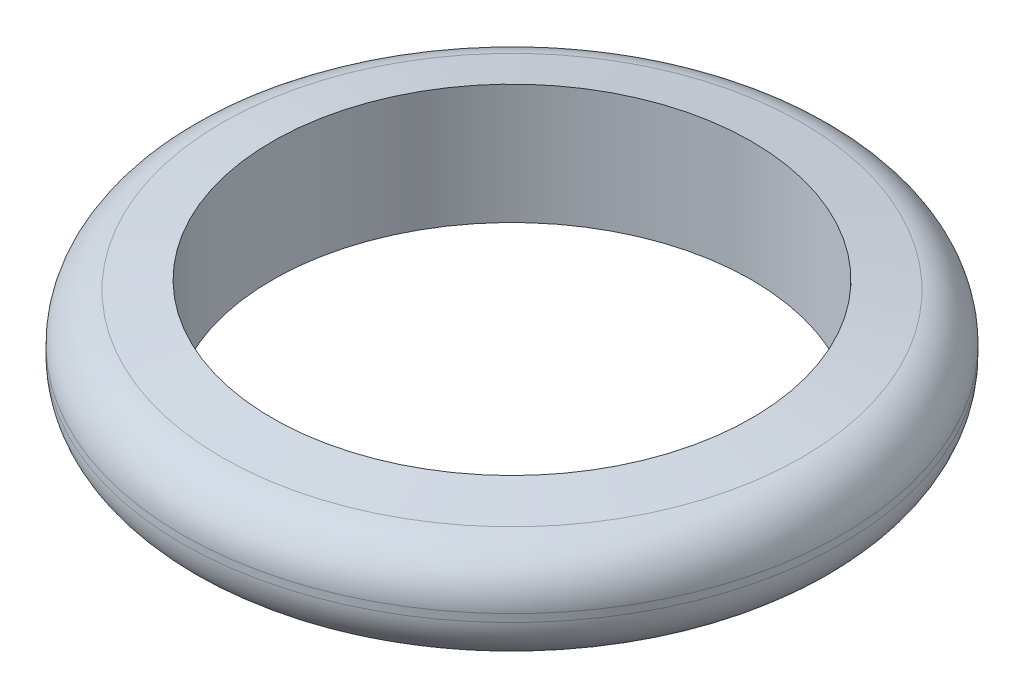
ISO-10303-21;
HEADER;
FILE_DESCRIPTION(('STEP AP214'),'2;1');
FILE_NAME('part.step','',(''),(''),'','','');
FILE_SCHEMA(('AUTOMOTIVE_DESIGN { 1 0 10303 214 1 1 1 1 }'));
ENDSEC;
DATA;
#1=APPLICATION_CONTEXT('core data for automotive mechanical design processes');
#2=APPLICATION_PROTOCOL_DEFINITION('international standard','automotive_design',2000,#1);
#3=PRODUCT_CONTEXT('',#1,'mechanical');
#4=PRODUCT('Part','Part','',(#3));
#5=PRODUCT_RELATED_PRODUCT_CATEGORY('part','',(#4));
#6=PRODUCT_DEFINITION_FORMATION('','',#4);
#7=PRODUCT_DEFINITION_CONTEXT('part definition',#1,'design');
#8=PRODUCT_DEFINITION('design','',#6,#7);
#9=PRODUCT_DEFINITION_SHAPE('','',#8);
#10=(LENGTH_UNIT() NAMED_UNIT(*) SI_UNIT(.MILLI.,.METRE.));
#11=(NAMED_UNIT(*) PLANE_ANGLE_UNIT() SI_UNIT($,.RADIAN.));
#12=(NAMED_UNIT(*) SI_UNIT($,.STERADIAN.) SOLID_ANGLE_UNIT());
#13=UNCERTAINTY_MEASURE_WITH_UNIT(LENGTH_MEASURE(1.E-05),#10,'distance_accuracy_value','');
#14=(GEOMETRIC_REPRESENTATION_CONTEXT(3) GLOBAL_UNCERTAINTY_ASSIGNED_CONTEXT((#13)) GLOBAL_UNIT_ASSIGNED_CONTEXT((#10,
#11,#12)) REPRESENTATION_CONTEXT('',''));
#15=CARTESIAN_POINT('',(0.,0.,0.));
#16=DIRECTION('',(0.,0.,1.));
#17=DIRECTION('',(1.,0.,0.));
#18=AXIS2_PLACEMENT_3D('',#15,#16,#17);
#19=CARTESIAN_POINT('',(0.,-10.,0.));
#20=DIRECTION('',(0.,1.,0.));
#21=DIRECTION('',(0.,0.,1.));
#22=AXIS2_PLACEMENT_3D('',#19,#20,#21);
#23=CONICAL_SURFACE('',#22,40.,1.39626340159547);
#24=CARTESIAN_POINT('',(0.,-8.52076026405252,0.));
#25=DIRECTION('',(0.,-1.,0.));
#26=DIRECTION('',(0.,0.,-1.));
#27=AXIS2_PLACEMENT_3D('',#24,#25,#26);
#28=CIRCLE('',#27,48.3891854213354);
#29=CARTESIAN_POINT('',(0.,-8.52076026405252,-48.3891854213354));
#30=VERTEX_POINT('',#29);
#31=EDGE_CURVE('E57',#30,#30,#28,.T.);
#32=ORIENTED_EDGE('',*,*,#31,.T.);
#33=EDGE_LOOP('',(#32));
#34=FACE_BOUND('',#33,.T.);
#35=CARTESIAN_POINT('',(0.,-10.,0.));
#36=DIRECTION('',(0.,-1.,0.));
#37=DIRECTION('',(0.,0.,-1.));
#38=AXIS2_PLACEMENT_3D('',#35,#36,#37);
#39=CIRCLE('',#38,40.);
#40=CARTESIAN_POINT('',(0.,-10.,-40.));
#41=VERTEX_POINT('',#40);
#42=EDGE_CURVE('E63',#41,#41,#39,.T.);
#43=ORIENTED_EDGE('',*,*,#42,.F.);
#44=EDGE_LOOP('',(#43));
#45=FACE_BOUND('',#44,.T.);
#46=ADVANCED_FACE('F39',(#34,#45),#23,.T.);
#47=CARTESIAN_POINT('',(0.,0.,0.));
#48=DIRECTION('',(0.,-1.,0.));
#49=DIRECTION('',(0.,0.,-1.));
#50=AXIS2_PLACEMENT_3D('',#47,#48,#49);
#51=CYLINDRICAL_SURFACE('',#50,40.);
#52=ORIENTED_EDGE('',*,*,#42,.T.);
#53=EDGE_LOOP('',(#52));
#54=FACE_BOUND('',#53,.T.);
#55=CARTESIAN_POINT('',(0.,10.,0.));
#56=DIRECTION('',(0.,-1.,0.));
#57=DIRECTION('',(0.,0.,-1.));
#58=AXIS2_PLACEMENT_3D('',#55,#56,#57);
#59=CIRCLE('',#58,40.);
#60=CARTESIAN_POINT('',(0.,10.,-40.));
#61=VERTEX_POINT('',#60);
#62=EDGE_CURVE('E67',#61,#61,#59,.T.);
#63=ORIENTED_EDGE('',*,*,#62,.F.);
#64=EDGE_LOOP('',(#63));
#65=FACE_BOUND('',#64,.T.);
#66=ADVANCED_FACE('F74',(#54,#65),#51,.F.);
#67=CARTESIAN_POINT('',(0.,7.35509528937313,0.));
#68=DIRECTION('',(0.,-1.,0.));
#69=DIRECTION('',(0.,0.,-1.));
#70=AXIS2_PLACEMENT_3D('',#67,#68,#69);
#71=CONICAL_SURFACE('',#70,55.,1.39626340159547);
#72=CARTESIAN_POINT('',(0.,8.52076026405252,0.));
#73=DIRECTION('',(0.,1.,0.));
#74=DIRECTION('',(0.,0.,1.));
#75=AXIS2_PLACEMENT_3D('',#72,#73,#74);
#76=CIRCLE('',#75,48.3891854213354);
#77=CARTESIAN_POINT('',(0.,8.52076026405252,48.3891854213354));
#78=VERTEX_POINT('',#77);
#79=EDGE_CURVE('E10',#78,#78,#76,.T.);
#80=ORIENTED_EDGE('',*,*,#79,.T.);
#81=EDGE_LOOP('',(#80));
#82=FACE_BOUND('',#81,.T.);
#83=ORIENTED_EDGE('',*,*,#62,.T.);
#84=EDGE_LOOP('',(#83));
#85=FACE_BOUND('',#84,.T.);
#86=ADVANCED_FACE('F72',(#82,#85),#71,.T.);
#87=CARTESIAN_POINT('',(0.,0.,0.));
#88=DIRECTION('',(0.,-1.,0.));
#89=DIRECTION('',(0.,0.,-1.));
#90=AXIS2_PLACEMENT_3D('',#87,#88,#89);
#91=CYLINDRICAL_SURFACE('',#90,55.);
#92=CARTESIAN_POINT('',(0.,-0.642298239954844,0.));
#93=DIRECTION('',(0.,1.,0.));
#94=DIRECTION('',(0.,0.,1.));
#95=AXIS2_PLACEMENT_3D('',#92,#93,#94);
#96=CIRCLE('',#95,55.);
#97=CARTESIAN_POINT('',(0.,-0.642298239954844,55.));
#98=VERTEX_POINT('',#97);
#99=EDGE_CURVE('E47',#98,#98,#96,.T.);
#100=ORIENTED_EDGE('',*,*,#99,.T.);
#101=EDGE_LOOP('',(#100));
#102=FACE_BOUND('',#101,.T.);
#103=CARTESIAN_POINT('',(0.,0.642298239954844,0.));
#104=DIRECTION('',(0.,1.,0.));
#105=DIRECTION('',(0.,0.,1.));
#106=AXIS2_PLACEMENT_3D('',#103,#104,#105);
#107=CIRCLE('',#106,55.);
#108=CARTESIAN_POINT('',(0.,0.642298239954844,55.));
#109=VERTEX_POINT('',#108);
#110=EDGE_CURVE('E52',#109,#109,#107,.F.);
#111=ORIENTED_EDGE('',*,*,#110,.T.);
#112=EDGE_LOOP('',(#111));
#113=FACE_BOUND('',#112,.T.);
#114=ADVANCED_FACE('F82',(#102,#113),#91,.T.);
#115=CARTESIAN_POINT('',(0.,-0.642298239954844,0.));
#116=DIRECTION('',(0.,1.,0.));
#117=DIRECTION('',(0.,0.,1.));
#118=AXIS2_PLACEMENT_3D('',#115,#116,#117);
#119=TOROIDAL_SURFACE('',#118,47.,8.);
#120=ORIENTED_EDGE('',*,*,#99,.F.);
#121=EDGE_LOOP('',(#120));
#122=FACE_BOUND('',#121,.T.);
#123=ORIENTED_EDGE('',*,*,#31,.F.);
#124=EDGE_LOOP('',(#123));
#125=FACE_BOUND('',#124,.T.);
#126=ADVANCED_FACE('F87',(#122,#125),#119,.T.);
#127=CARTESIAN_POINT('',(0.,0.642298239954844,0.));
#128=DIRECTION('',(0.,1.,0.));
#129=DIRECTION('',(0.,0.,1.));
#130=AXIS2_PLACEMENT_3D('',#127,#128,#129);
#131=TOROIDAL_SURFACE('',#130,47.,8.);
#132=ORIENTED_EDGE('',*,*,#79,.F.);
#133=EDGE_LOOP('',(#132));
#134=FACE_BOUND('',#133,.T.);
#135=ORIENTED_EDGE('',*,*,#110,.F.);
#136=EDGE_LOOP('',(#135));
#137=FACE_BOUND('',#136,.T.);
#138=ADVANCED_FACE('F41',(#134,#137),#131,.T.);
#139=CLOSED_SHELL('',(#46,#66,#86,#114,#126,#138));
#140=MANIFOLD_SOLID_BREP('B2',#139);
#141=ADVANCED_BREP_SHAPE_REPRESENTATION('',(#18,#140),#14);
#142=SHAPE_DEFINITION_REPRESENTATION(#9,#141);
ENDSEC;
END-ISO-10303-21;
